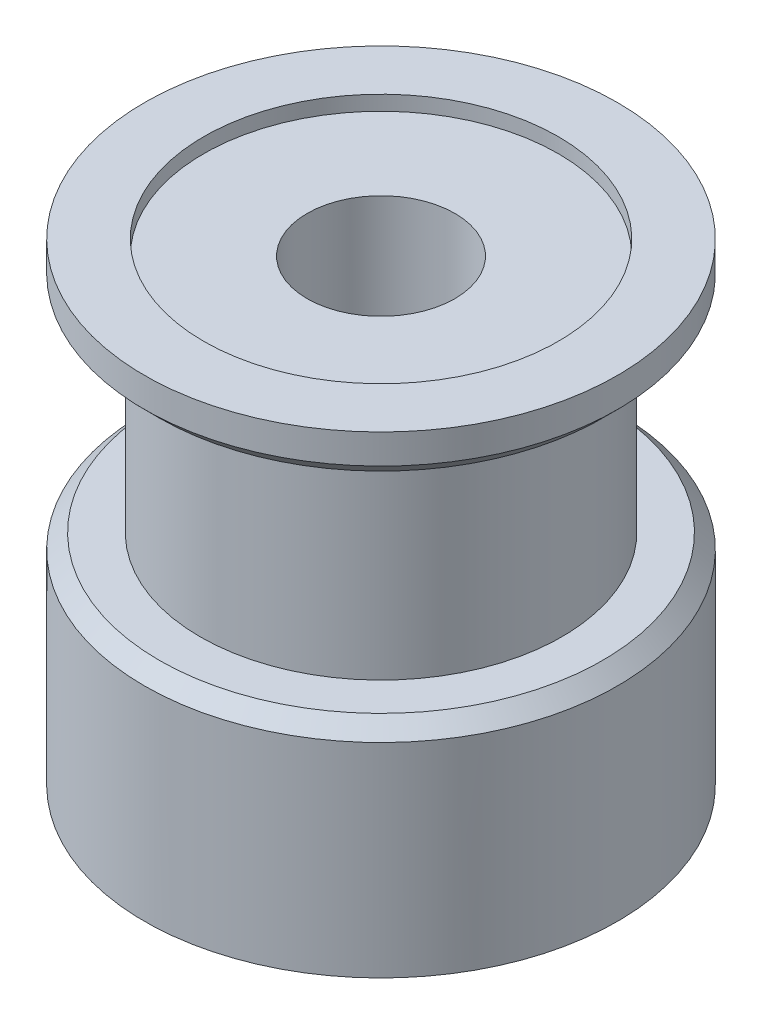
ISO-10303-21;
HEADER;
FILE_DESCRIPTION(('STEP AP214'),'2;1');
FILE_NAME('part.step','',(''),(''),'','','');
FILE_SCHEMA(('AUTOMOTIVE_DESIGN { 1 0 10303 214 1 1 1 1 }'));
ENDSEC;
DATA;
#1=APPLICATION_CONTEXT('core data for automotive mechanical design processes');
#2=APPLICATION_PROTOCOL_DEFINITION('international standard','automotive_design',2000,#1);
#3=PRODUCT_CONTEXT('',#1,'mechanical');
#4=PRODUCT('Part','Part','',(#3));
#5=PRODUCT_RELATED_PRODUCT_CATEGORY('part','',(#4));
#6=PRODUCT_DEFINITION_FORMATION('','',#4);
#7=PRODUCT_DEFINITION_CONTEXT('part definition',#1,'design');
#8=PRODUCT_DEFINITION('design','',#6,#7);
#9=PRODUCT_DEFINITION_SHAPE('','',#8);
#10=(LENGTH_UNIT() NAMED_UNIT(*) SI_UNIT(.MILLI.,.METRE.));
#11=(NAMED_UNIT(*) PLANE_ANGLE_UNIT() SI_UNIT($,.RADIAN.));
#12=(NAMED_UNIT(*) SI_UNIT($,.STERADIAN.) SOLID_ANGLE_UNIT());
#13=UNCERTAINTY_MEASURE_WITH_UNIT(LENGTH_MEASURE(1.E-05),#10,'distance_accuracy_value','');
#14=(GEOMETRIC_REPRESENTATION_CONTEXT(3) GLOBAL_UNCERTAINTY_ASSIGNED_CONTEXT((#13)) GLOBAL_UNIT_ASSIGNED_CONTEXT((#10,
#11,#12)) REPRESENTATION_CONTEXT('',''));
#15=CARTESIAN_POINT('',(0.,0.,0.));
#16=DIRECTION('',(0.,0.,1.));
#17=DIRECTION('',(1.,0.,0.));
#18=AXIS2_PLACEMENT_3D('',#15,#16,#17);
#19=CARTESIAN_POINT('',(0.,0.,0.));
#20=DIRECTION('',(0.,-1.,0.));
#21=DIRECTION('',(0.,0.,-1.));
#22=AXIS2_PLACEMENT_3D('',#19,#20,#21);
#23=CYLINDRICAL_SURFACE('',#22,2.5);
#24=CARTESIAN_POINT('',(0.,0.,0.));
#25=DIRECTION('',(0.,-1.,0.));
#26=DIRECTION('',(0.,0.,-1.));
#27=AXIS2_PLACEMENT_3D('',#24,#25,#26);
#28=CIRCLE('',#27,2.5);
#29=CARTESIAN_POINT('',(0.,0.,-2.5));
#30=VERTEX_POINT('',#29);
#31=EDGE_CURVE('E64',#30,#30,#28,.T.);
#32=ORIENTED_EDGE('',*,*,#31,.T.);
#33=EDGE_LOOP('',(#32));
#34=FACE_BOUND('',#33,.T.);
#35=CARTESIAN_POINT('',(0.,15.5,0.));
#36=DIRECTION('',(0.,1.,0.));
#37=DIRECTION('',(0.,0.,1.));
#38=AXIS2_PLACEMENT_3D('',#35,#36,#37);
#39=CIRCLE('',#38,2.5);
#40=CARTESIAN_POINT('',(0.,15.5,2.5));
#41=VERTEX_POINT('',#40);
#42=EDGE_CURVE('E48',#41,#41,#39,.T.);
#43=ORIENTED_EDGE('',*,*,#42,.T.);
#44=EDGE_LOOP('',(#43));
#45=FACE_BOUND('',#44,.T.);
#46=ADVANCED_FACE('F43',(#34,#45),#23,.F.);
#47=CARTESIAN_POINT('',(8.00000000000001,0.,0.));
#48=DIRECTION('',(0.,-1.,0.));
#49=DIRECTION('',(0.,0.,-1.));
#50=AXIS2_PLACEMENT_3D('',#47,#48,#49);
#51=PLANE('',#50);
#52=CARTESIAN_POINT('',(0.,0.,0.));
#53=DIRECTION('',(0.,-1.,0.));
#54=DIRECTION('',(0.,0.,-1.));
#55=AXIS2_PLACEMENT_3D('',#52,#53,#54);
#56=CIRCLE('',#55,8.00000000000001);
#57=CARTESIAN_POINT('',(0.,0.,-8.00000000000001));
#58=VERTEX_POINT('',#57);
#59=EDGE_CURVE('E76',#58,#58,#56,.T.);
#60=ORIENTED_EDGE('',*,*,#59,.T.);
#61=EDGE_LOOP('',(#60));
#62=FACE_BOUND('',#61,.T.);
#63=ORIENTED_EDGE('',*,*,#31,.F.);
#64=EDGE_LOOP('',(#63));
#65=FACE_BOUND('',#64,.T.);
#66=ADVANCED_FACE('F100',(#62,#65),#51,.T.);
#67=CARTESIAN_POINT('',(2.5,16.,0.));
#68=DIRECTION('',(0.,1.,0.));
#69=DIRECTION('',(0.,0.,1.));
#70=AXIS2_PLACEMENT_3D('',#67,#68,#69);
#71=PLANE('',#70);
#72=CARTESIAN_POINT('',(0.,16.,0.));
#73=DIRECTION('',(0.,1.,0.));
#74=DIRECTION('',(0.,0.,1.));
#75=AXIS2_PLACEMENT_3D('',#72,#73,#74);
#76=CIRCLE('',#75,6.);
#77=CARTESIAN_POINT('',(0.,16.,6.));
#78=VERTEX_POINT('',#77);
#79=EDGE_CURVE('E79',#78,#78,#76,.T.);
#80=ORIENTED_EDGE('',*,*,#79,.F.);
#81=EDGE_LOOP('',(#80));
#82=FACE_BOUND('',#81,.T.);
#83=CARTESIAN_POINT('',(0.,16.,0.));
#84=DIRECTION('',(0.,-1.,0.));
#85=DIRECTION('',(0.,0.,-1.));
#86=AXIS2_PLACEMENT_3D('',#83,#84,#85);
#87=CIRCLE('',#86,8.);
#88=CARTESIAN_POINT('',(0.,16.,-8.));
#89=VERTEX_POINT('',#88);
#90=EDGE_CURVE('E67',#89,#89,#87,.T.);
#91=ORIENTED_EDGE('',*,*,#90,.F.);
#92=EDGE_LOOP('',(#91));
#93=FACE_BOUND('',#92,.T.);
#94=ADVANCED_FACE('F106',(#82,#93),#71,.T.);
#95=CARTESIAN_POINT('',(0.,0.,0.));
#96=DIRECTION('',(0.,-1.,0.));
#97=DIRECTION('',(0.,0.,-1.));
#98=AXIS2_PLACEMENT_3D('',#95,#96,#97);
#99=CYLINDRICAL_SURFACE('',#98,8.);
#100=CARTESIAN_POINT('',(0.,15.,0.));
#101=DIRECTION('',(0.,-1.,0.));
#102=DIRECTION('',(0.,0.,-1.));
#103=AXIS2_PLACEMENT_3D('',#100,#101,#102);
#104=CIRCLE('',#103,8.);
#105=CARTESIAN_POINT('',(0.,15.,-8.));
#106=VERTEX_POINT('',#105);
#107=EDGE_CURVE('E56',#106,#106,#104,.F.);
#108=ORIENTED_EDGE('',*,*,#107,.T.);
#109=EDGE_LOOP('',(#108));
#110=FACE_BOUND('',#109,.T.);
#111=ORIENTED_EDGE('',*,*,#90,.T.);
#112=EDGE_LOOP('',(#111));
#113=FACE_BOUND('',#112,.T.);
#114=ADVANCED_FACE('F134',(#110,#113),#99,.T.);
#115=CARTESIAN_POINT('',(8.,14.5,0.));
#116=DIRECTION('',(0.,-1.,0.));
#117=DIRECTION('',(0.,0.,-1.));
#118=AXIS2_PLACEMENT_3D('',#115,#116,#117);
#119=PLANE('',#118);
#120=CARTESIAN_POINT('',(0.,14.5,0.));
#121=DIRECTION('',(0.,-1.,0.));
#122=DIRECTION('',(0.,0.,-1.));
#123=AXIS2_PLACEMENT_3D('',#120,#121,#122);
#124=CIRCLE('',#123,7.50000000000001);
#125=CARTESIAN_POINT('',(0.,14.5,-7.50000000000001));
#126=VERTEX_POINT('',#125);
#127=EDGE_CURVE('E61',#126,#126,#124,.T.);
#128=ORIENTED_EDGE('',*,*,#127,.T.);
#129=EDGE_LOOP('',(#128));
#130=FACE_BOUND('',#129,.T.);
#131=CARTESIAN_POINT('',(0.,14.5,0.));
#132=DIRECTION('',(0.,-1.,0.));
#133=DIRECTION('',(0.,0.,-1.));
#134=AXIS2_PLACEMENT_3D('',#131,#132,#133);
#135=CIRCLE('',#134,6.12);
#136=CARTESIAN_POINT('',(0.,14.5,-6.12));
#137=VERTEX_POINT('',#136);
#138=EDGE_CURVE('E70',#137,#137,#135,.T.);
#139=ORIENTED_EDGE('',*,*,#138,.F.);
#140=EDGE_LOOP('',(#139));
#141=FACE_BOUND('',#140,.T.);
#142=ADVANCED_FACE('F130',(#130,#141),#119,.T.);
#143=CARTESIAN_POINT('',(0.,0.,0.));
#144=DIRECTION('',(0.,-1.,0.));
#145=DIRECTION('',(0.,0.,-1.));
#146=AXIS2_PLACEMENT_3D('',#143,#144,#145);
#147=CYLINDRICAL_SURFACE('',#146,6.12);
#148=ORIENTED_EDGE('',*,*,#138,.T.);
#149=EDGE_LOOP('',(#148));
#150=FACE_BOUND('',#149,.T.);
#151=CARTESIAN_POINT('',(0.,7.4,0.));
#152=DIRECTION('',(0.,-1.,0.));
#153=DIRECTION('',(0.,0.,-1.));
#154=AXIS2_PLACEMENT_3D('',#151,#152,#153);
#155=CIRCLE('',#154,6.12);
#156=CARTESIAN_POINT('',(0.,7.4,-6.12));
#157=VERTEX_POINT('',#156);
#158=EDGE_CURVE('E73',#157,#157,#155,.T.);
#159=ORIENTED_EDGE('',*,*,#158,.F.);
#160=EDGE_LOOP('',(#159));
#161=FACE_BOUND('',#160,.T.);
#162=ADVANCED_FACE('F133',(#150,#161),#147,.T.);
#163=CARTESIAN_POINT('',(6.12,7.4,0.));
#164=DIRECTION('',(0.,1.,0.));
#165=DIRECTION('',(0.,0.,1.));
#166=AXIS2_PLACEMENT_3D('',#163,#164,#165);
#167=PLANE('',#166);
#168=CARTESIAN_POINT('',(0.,7.4,0.));
#169=DIRECTION('',(0.,1.,0.));
#170=DIRECTION('',(0.,0.,1.));
#171=AXIS2_PLACEMENT_3D('',#168,#169,#170);
#172=CIRCLE('',#171,7.50000000000001);
#173=CARTESIAN_POINT('',(0.,7.4,7.50000000000001));
#174=VERTEX_POINT('',#173);
#175=EDGE_CURVE('E10',#174,#174,#172,.T.);
#176=ORIENTED_EDGE('',*,*,#175,.T.);
#177=EDGE_LOOP('',(#176));
#178=FACE_BOUND('',#177,.T.);
#179=ORIENTED_EDGE('',*,*,#158,.T.);
#180=EDGE_LOOP('',(#179));
#181=FACE_BOUND('',#180,.T.);
#182=ADVANCED_FACE('F123',(#178,#181),#167,.T.);
#183=CARTESIAN_POINT('',(0.,0.,0.));
#184=DIRECTION('',(0.,-1.,0.));
#185=DIRECTION('',(0.,0.,-1.));
#186=AXIS2_PLACEMENT_3D('',#183,#184,#185);
#187=CYLINDRICAL_SURFACE('',#186,8.00000000000001);
#188=CARTESIAN_POINT('',(0.,6.9,0.));
#189=DIRECTION('',(0.,1.,0.));
#190=DIRECTION('',(0.,0.,1.));
#191=AXIS2_PLACEMENT_3D('',#188,#189,#190);
#192=CIRCLE('',#191,8.00000000000001);
#193=CARTESIAN_POINT('',(0.,6.9,8.00000000000001));
#194=VERTEX_POINT('',#193);
#195=EDGE_CURVE('E52',#194,#194,#192,.F.);
#196=ORIENTED_EDGE('',*,*,#195,.T.);
#197=EDGE_LOOP('',(#196));
#198=FACE_BOUND('',#197,.T.);
#199=ORIENTED_EDGE('',*,*,#59,.F.);
#200=EDGE_LOOP('',(#199));
#201=FACE_BOUND('',#200,.T.);
#202=ADVANCED_FACE('F116',(#198,#201),#187,.T.);
#203=CARTESIAN_POINT('',(0.,14.5,0.));
#204=DIRECTION('',(0.,1.,0.));
#205=DIRECTION('',(0.,0.,1.));
#206=AXIS2_PLACEMENT_3D('',#203,#204,#205);
#207=CONICAL_SURFACE('',#206,7.50000000000001,0.785398163397445);
#208=ORIENTED_EDGE('',*,*,#107,.F.);
#209=EDGE_LOOP('',(#208));
#210=FACE_BOUND('',#209,.T.);
#211=ORIENTED_EDGE('',*,*,#127,.F.);
#212=EDGE_LOOP('',(#211));
#213=FACE_BOUND('',#212,.T.);
#214=ADVANCED_FACE('F112',(#210,#213),#207,.T.);
#215=CARTESIAN_POINT('',(0.,6.9,0.));
#216=DIRECTION('',(0.,-1.,0.));
#217=DIRECTION('',(0.,0.,-1.));
#218=AXIS2_PLACEMENT_3D('',#215,#216,#217);
#219=CONICAL_SURFACE('',#218,8.00000000000001,0.785398163397452);
#220=ORIENTED_EDGE('',*,*,#175,.F.);
#221=EDGE_LOOP('',(#220));
#222=FACE_BOUND('',#221,.T.);
#223=ORIENTED_EDGE('',*,*,#195,.F.);
#224=EDGE_LOOP('',(#223));
#225=FACE_BOUND('',#224,.T.);
#226=ADVANCED_FACE('F46',(#222,#225),#219,.T.);
#227=CARTESIAN_POINT('',(0.,15.5,0.));
#228=DIRECTION('',(0.,1.,0.));
#229=DIRECTION('',(0.,0.,1.));
#230=AXIS2_PLACEMENT_3D('',#227,#228,#229);
#231=CYLINDRICAL_SURFACE('',#230,6.);
#232=CARTESIAN_POINT('',(0.,15.5,0.));
#233=DIRECTION('',(0.,1.,0.));
#234=DIRECTION('',(0.,0.,1.));
#235=AXIS2_PLACEMENT_3D('',#232,#233,#234);
#236=CIRCLE('',#235,6.);
#237=CARTESIAN_POINT('',(0.,15.5,6.));
#238=VERTEX_POINT('',#237);
#239=EDGE_CURVE('E82',#238,#238,#236,.T.);
#240=ORIENTED_EDGE('',*,*,#239,.F.);
#241=EDGE_LOOP('',(#240));
#242=FACE_BOUND('',#241,.T.);
#243=ORIENTED_EDGE('',*,*,#79,.T.);
#244=EDGE_LOOP('',(#243));
#245=FACE_BOUND('',#244,.T.);
#246=ADVANCED_FACE('F92',(#242,#245),#231,.F.);
#247=CARTESIAN_POINT('',(0.,15.5,0.));
#248=DIRECTION('',(0.,1.,0.));
#249=DIRECTION('',(0.,0.,1.));
#250=AXIS2_PLACEMENT_3D('',#247,#248,#249);
#251=PLANE('',#250);
#252=ORIENTED_EDGE('',*,*,#42,.F.);
#253=EDGE_LOOP('',(#252));
#254=FACE_BOUND('',#253,.T.);
#255=ORIENTED_EDGE('',*,*,#239,.T.);
#256=EDGE_LOOP('',(#255));
#257=FACE_BOUND('',#256,.T.);
#258=ADVANCED_FACE('F90',(#254,#257),#251,.T.);
#259=CLOSED_SHELL('',(#46,#66,#94,#114,#142,#162,#182,#202,#214,#226,#246,#258));
#260=MANIFOLD_SOLID_BREP('B2',#259);
#261=ADVANCED_BREP_SHAPE_REPRESENTATION('',(#18,#260),#14);
#262=SHAPE_DEFINITION_REPRESENTATION(#9,#261);
ENDSEC;
END-ISO-10303-21;
